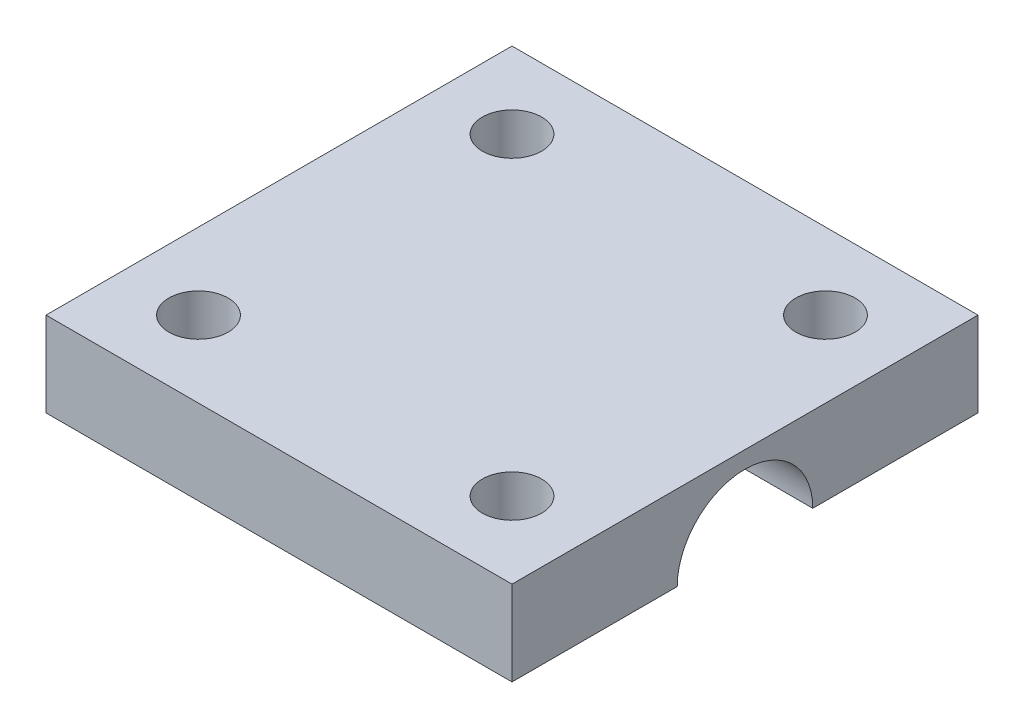
ISO-10303-21;
HEADER;
FILE_DESCRIPTION(('STEP AP214'),'2;1');
FILE_NAME('part.step','',(''),(''),'','','');
FILE_SCHEMA(('AUTOMOTIVE_DESIGN { 1 0 10303 214 1 1 1 1 }'));
ENDSEC;
DATA;
#1=APPLICATION_CONTEXT('core data for automotive mechanical design processes');
#2=APPLICATION_PROTOCOL_DEFINITION('international standard','automotive_design',2000,#1);
#3=PRODUCT_CONTEXT('',#1,'mechanical');
#4=PRODUCT('Part','Part','',(#3));
#5=PRODUCT_RELATED_PRODUCT_CATEGORY('part','',(#4));
#6=PRODUCT_DEFINITION_FORMATION('','',#4);
#7=PRODUCT_DEFINITION_CONTEXT('part definition',#1,'design');
#8=PRODUCT_DEFINITION('design','',#6,#7);
#9=PRODUCT_DEFINITION_SHAPE('','',#8);
#10=(LENGTH_UNIT() NAMED_UNIT(*) SI_UNIT(.MILLI.,.METRE.));
#11=(NAMED_UNIT(*) PLANE_ANGLE_UNIT() SI_UNIT($,.RADIAN.));
#12=(NAMED_UNIT(*) SI_UNIT($,.STERADIAN.) SOLID_ANGLE_UNIT());
#13=UNCERTAINTY_MEASURE_WITH_UNIT(LENGTH_MEASURE(1.E-05),#10,'distance_accuracy_value','');
#14=(GEOMETRIC_REPRESENTATION_CONTEXT(3) GLOBAL_UNCERTAINTY_ASSIGNED_CONTEXT((#13)) GLOBAL_UNIT_ASSIGNED_CONTEXT((#10,
#11,#12)) REPRESENTATION_CONTEXT('',''));
#15=CARTESIAN_POINT('',(0.,0.,0.));
#16=DIRECTION('',(0.,0.,1.));
#17=DIRECTION('',(1.,0.,0.));
#18=AXIS2_PLACEMENT_3D('',#15,#16,#17);
#19=CARTESIAN_POINT('',(27.5,10.,-27.5));
#20=DIRECTION('',(-1.,0.,0.));
#21=DIRECTION('',(0.,0.,1.));
#22=AXIS2_PLACEMENT_3D('',#19,#20,#21);
#23=PLANE('',#22);
#24=DIRECTION('',(0.,0.,-1.));
#25=VECTOR('',#24,1.);
#26=CARTESIAN_POINT('',(27.5,0.,-27.5));
#27=LINE('',#26,#25);
#28=CARTESIAN_POINT('',(27.5,0.,27.5));
#29=VERTEX_POINT('',#28);
#30=CARTESIAN_POINT('',(27.5,0.,8.));
#31=VERTEX_POINT('',#30);
#32=EDGE_CURVE('E125',#29,#31,#27,.T.);
#33=ORIENTED_EDGE('',*,*,#32,.T.);
#34=CARTESIAN_POINT('',(27.5,0.,0.));
#35=DIRECTION('',(1.,0.,0.));
#36=DIRECTION('',(0.,0.,-1.));
#37=AXIS2_PLACEMENT_3D('',#34,#35,#36);
#38=CIRCLE('',#37,8.);
#39=CARTESIAN_POINT('',(27.5,0.,-8.));
#40=VERTEX_POINT('',#39);
#41=EDGE_CURVE('E112',#40,#31,#38,.T.);
#42=ORIENTED_EDGE('',*,*,#41,.F.);
#43=CARTESIAN_POINT('',(27.5,0.,-27.5));
#44=VERTEX_POINT('',#43);
#45=EDGE_CURVE('E122',#40,#44,#27,.T.);
#46=ORIENTED_EDGE('',*,*,#45,.T.);
#47=DIRECTION('',(0.,-1.,0.));
#48=VECTOR('',#47,1.);
#49=CARTESIAN_POINT('',(27.5,10.,-27.5));
#50=LINE('',#49,#48);
#51=CARTESIAN_POINT('',(27.5,10.,-27.5));
#52=VERTEX_POINT('',#51);
#53=EDGE_CURVE('E157',#52,#44,#50,.T.);
#54=ORIENTED_EDGE('',*,*,#53,.F.);
#55=DIRECTION('',(0.,0.,-1.));
#56=VECTOR('',#55,1.);
#57=CARTESIAN_POINT('',(27.5,10.,-27.5));
#58=LINE('',#57,#56);
#59=CARTESIAN_POINT('',(27.5,10.,27.5));
#60=VERTEX_POINT('',#59);
#61=EDGE_CURVE('E146',#60,#52,#58,.T.);
#62=ORIENTED_EDGE('',*,*,#61,.F.);
#63=DIRECTION('',(0.,-1.,0.));
#64=VECTOR('',#63,1.);
#65=CARTESIAN_POINT('',(27.5,10.,27.5));
#66=LINE('',#65,#64);
#67=EDGE_CURVE('E147',#60,#29,#66,.T.);
#68=ORIENTED_EDGE('',*,*,#67,.T.);
#69=EDGE_LOOP('',(#33,#42,#46,#54,#62,#68));
#70=FACE_BOUND('',#69,.T.);
#71=ADVANCED_FACE('F46',(#70),#23,.F.);
#72=CARTESIAN_POINT('',(-27.5,10.,-27.5));
#73=DIRECTION('',(0.,0.,1.));
#74=DIRECTION('',(1.,0.,0.));
#75=AXIS2_PLACEMENT_3D('',#72,#73,#74);
#76=PLANE('',#75);
#77=DIRECTION('',(-1.,0.,0.));
#78=VECTOR('',#77,1.);
#79=CARTESIAN_POINT('',(-27.5,0.,-27.5));
#80=LINE('',#79,#78);
#81=CARTESIAN_POINT('',(-27.5,0.,-27.5));
#82=VERTEX_POINT('',#81);
#83=EDGE_CURVE('E130',#44,#82,#80,.T.);
#84=ORIENTED_EDGE('',*,*,#83,.T.);
#85=DIRECTION('',(0.,-1.,0.));
#86=VECTOR('',#85,1.);
#87=CARTESIAN_POINT('',(-27.5,10.,-27.5));
#88=LINE('',#87,#86);
#89=CARTESIAN_POINT('',(-27.5,10.,-27.5));
#90=VERTEX_POINT('',#89);
#91=EDGE_CURVE('E153',#90,#82,#88,.T.);
#92=ORIENTED_EDGE('',*,*,#91,.F.);
#93=DIRECTION('',(-1.,0.,0.));
#94=VECTOR('',#93,1.);
#95=CARTESIAN_POINT('',(-27.5,10.,-27.5));
#96=LINE('',#95,#94);
#97=EDGE_CURVE('E100',#52,#90,#96,.T.);
#98=ORIENTED_EDGE('',*,*,#97,.F.);
#99=ORIENTED_EDGE('',*,*,#53,.T.);
#100=EDGE_LOOP('',(#84,#92,#98,#99));
#101=FACE_BOUND('',#100,.T.);
#102=ADVANCED_FACE('F194',(#101),#76,.F.);
#103=CARTESIAN_POINT('',(-27.5,10.,-27.5));
#104=DIRECTION('',(1.,0.,0.));
#105=DIRECTION('',(0.,0.,-1.));
#106=AXIS2_PLACEMENT_3D('',#103,#104,#105);
#107=PLANE('',#106);
#108=DIRECTION('',(0.,0.,1.));
#109=VECTOR('',#108,1.);
#110=CARTESIAN_POINT('',(-27.5,0.,-27.5));
#111=LINE('',#110,#109);
#112=CARTESIAN_POINT('',(-27.5,0.,27.5));
#113=VERTEX_POINT('',#112);
#114=EDGE_CURVE('E141',#82,#113,#111,.T.);
#115=ORIENTED_EDGE('',*,*,#114,.T.);
#116=DIRECTION('',(0.,-1.,0.));
#117=VECTOR('',#116,1.);
#118=CARTESIAN_POINT('',(-27.5,10.,27.5));
#119=LINE('',#118,#117);
#120=CARTESIAN_POINT('',(-27.5,10.,27.5));
#121=VERTEX_POINT('',#120);
#122=EDGE_CURVE('E150',#121,#113,#119,.T.);
#123=ORIENTED_EDGE('',*,*,#122,.F.);
#124=DIRECTION('',(0.,0.,1.));
#125=VECTOR('',#124,1.);
#126=CARTESIAN_POINT('',(-27.5,10.,-27.5));
#127=LINE('',#126,#125);
#128=EDGE_CURVE('E243',#90,#121,#127,.T.);
#129=ORIENTED_EDGE('',*,*,#128,.F.);
#130=ORIENTED_EDGE('',*,*,#91,.T.);
#131=EDGE_LOOP('',(#115,#123,#129,#130));
#132=FACE_BOUND('',#131,.T.);
#133=ADVANCED_FACE('F198',(#132),#107,.F.);
#134=CARTESIAN_POINT('',(-27.5,10.,27.5));
#135=DIRECTION('',(0.,0.,-1.));
#136=DIRECTION('',(-1.,0.,0.));
#137=AXIS2_PLACEMENT_3D('',#134,#135,#136);
#138=PLANE('',#137);
#139=DIRECTION('',(1.,0.,0.));
#140=VECTOR('',#139,1.);
#141=CARTESIAN_POINT('',(-27.5,0.,27.5));
#142=LINE('',#141,#140);
#143=EDGE_CURVE('E92',#113,#29,#142,.T.);
#144=ORIENTED_EDGE('',*,*,#143,.T.);
#145=ORIENTED_EDGE('',*,*,#67,.F.);
#146=DIRECTION('',(1.,0.,0.));
#147=VECTOR('',#146,1.);
#148=CARTESIAN_POINT('',(-27.5,10.,27.5));
#149=LINE('',#148,#147);
#150=EDGE_CURVE('E71',#121,#60,#149,.T.);
#151=ORIENTED_EDGE('',*,*,#150,.F.);
#152=ORIENTED_EDGE('',*,*,#122,.T.);
#153=EDGE_LOOP('',(#144,#145,#151,#152));
#154=FACE_BOUND('',#153,.T.);
#155=ADVANCED_FACE('F202',(#154),#138,.F.);
#156=CARTESIAN_POINT('',(0.,10.,0.));
#157=DIRECTION('',(0.,1.,0.));
#158=DIRECTION('',(0.,0.,1.));
#159=AXIS2_PLACEMENT_3D('',#156,#157,#158);
#160=PLANE('',#159);
#161=CARTESIAN_POINT('',(18.5,10.,-18.5));
#162=DIRECTION('',(0.,1.,0.));
#163=DIRECTION('',(0.,0.,1.));
#164=AXIS2_PLACEMENT_3D('',#161,#162,#163);
#165=CIRCLE('',#164,3.5);
#166=CARTESIAN_POINT('',(18.5,10.,-15.));
#167=VERTEX_POINT('',#166);
#168=EDGE_CURVE('E233',#167,#167,#165,.T.);
#169=ORIENTED_EDGE('',*,*,#168,.F.);
#170=EDGE_LOOP('',(#169));
#171=FACE_BOUND('',#170,.T.);
#172=CARTESIAN_POINT('',(-18.5,10.,18.5));
#173=DIRECTION('',(0.,1.,0.));
#174=DIRECTION('',(0.,0.,1.));
#175=AXIS2_PLACEMENT_3D('',#172,#173,#174);
#176=CIRCLE('',#175,3.5);
#177=CARTESIAN_POINT('',(-18.5,10.,22.));
#178=VERTEX_POINT('',#177);
#179=EDGE_CURVE('E236',#178,#178,#176,.T.);
#180=ORIENTED_EDGE('',*,*,#179,.F.);
#181=EDGE_LOOP('',(#180));
#182=FACE_BOUND('',#181,.T.);
#183=CARTESIAN_POINT('',(18.5,10.,18.5));
#184=DIRECTION('',(0.,1.,0.));
#185=DIRECTION('',(0.,0.,1.));
#186=AXIS2_PLACEMENT_3D('',#183,#184,#185);
#187=CIRCLE('',#186,3.5);
#188=CARTESIAN_POINT('',(18.5,10.,22.));
#189=VERTEX_POINT('',#188);
#190=EDGE_CURVE('E251',#189,#189,#187,.T.);
#191=ORIENTED_EDGE('',*,*,#190,.F.);
#192=EDGE_LOOP('',(#191));
#193=FACE_BOUND('',#192,.T.);
#194=CARTESIAN_POINT('',(-18.5,10.,-18.5));
#195=DIRECTION('',(0.,1.,0.));
#196=DIRECTION('',(0.,0.,1.));
#197=AXIS2_PLACEMENT_3D('',#194,#195,#196);
#198=CIRCLE('',#197,3.5);
#199=CARTESIAN_POINT('',(-18.5,10.,-15.));
#200=VERTEX_POINT('',#199);
#201=EDGE_CURVE('E167',#200,#200,#198,.T.);
#202=ORIENTED_EDGE('',*,*,#201,.F.);
#203=EDGE_LOOP('',(#202));
#204=FACE_BOUND('',#203,.T.);
#205=ORIENTED_EDGE('',*,*,#61,.T.);
#206=ORIENTED_EDGE('',*,*,#97,.T.);
#207=ORIENTED_EDGE('',*,*,#128,.T.);
#208=ORIENTED_EDGE('',*,*,#150,.T.);
#209=EDGE_LOOP('',(#205,#206,#207,#208));
#210=FACE_BOUND('',#209,.T.);
#211=ADVANCED_FACE('F208',(#171,#182,#193,#204,#210),#160,.T.);
#212=CARTESIAN_POINT('',(0.,0.,0.));
#213=DIRECTION('',(0.,1.,0.));
#214=DIRECTION('',(0.,0.,1.));
#215=AXIS2_PLACEMENT_3D('',#212,#213,#214);
#216=PLANE('',#215);
#217=CARTESIAN_POINT('',(18.5,0.,-18.5));
#218=DIRECTION('',(0.,1.,0.));
#219=DIRECTION('',(0.,0.,1.));
#220=AXIS2_PLACEMENT_3D('',#217,#218,#219);
#221=CIRCLE('',#220,3.5);
#222=CARTESIAN_POINT('',(18.5,0.,-15.));
#223=VERTEX_POINT('',#222);
#224=EDGE_CURVE('E49',#223,#223,#221,.T.);
#225=ORIENTED_EDGE('',*,*,#224,.T.);
#226=EDGE_LOOP('',(#225));
#227=FACE_BOUND('',#226,.T.);
#228=CARTESIAN_POINT('',(-18.5,0.,18.5));
#229=DIRECTION('',(0.,1.,0.));
#230=DIRECTION('',(0.,0.,1.));
#231=AXIS2_PLACEMENT_3D('',#228,#229,#230);
#232=CIRCLE('',#231,3.5);
#233=CARTESIAN_POINT('',(-18.5,0.,22.));
#234=VERTEX_POINT('',#233);
#235=EDGE_CURVE('E170',#234,#234,#232,.T.);
#236=ORIENTED_EDGE('',*,*,#235,.T.);
#237=EDGE_LOOP('',(#236));
#238=FACE_BOUND('',#237,.T.);
#239=CARTESIAN_POINT('',(18.5,0.,18.5));
#240=DIRECTION('',(0.,1.,0.));
#241=DIRECTION('',(0.,0.,1.));
#242=AXIS2_PLACEMENT_3D('',#239,#240,#241);
#243=CIRCLE('',#242,3.5);
#244=CARTESIAN_POINT('',(18.5,0.,22.));
#245=VERTEX_POINT('',#244);
#246=EDGE_CURVE('E166',#245,#245,#243,.T.);
#247=ORIENTED_EDGE('',*,*,#246,.T.);
#248=EDGE_LOOP('',(#247));
#249=FACE_BOUND('',#248,.T.);
#250=CARTESIAN_POINT('',(-18.5,0.,-18.5));
#251=DIRECTION('',(0.,1.,0.));
#252=DIRECTION('',(0.,0.,1.));
#253=AXIS2_PLACEMENT_3D('',#250,#251,#252);
#254=CIRCLE('',#253,3.5);
#255=CARTESIAN_POINT('',(-18.5,0.,-15.));
#256=VERTEX_POINT('',#255);
#257=EDGE_CURVE('E162',#256,#256,#254,.T.);
#258=ORIENTED_EDGE('',*,*,#257,.T.);
#259=EDGE_LOOP('',(#258));
#260=FACE_BOUND('',#259,.T.);
#261=DIRECTION('',(0.,0.,-1.));
#262=VECTOR('',#261,1.);
#263=CARTESIAN_POINT('',(-22.5,0.,0.));
#264=LINE('',#263,#262);
#265=CARTESIAN_POINT('',(-22.5,0.,8.));
#266=VERTEX_POINT('',#265);
#267=CARTESIAN_POINT('',(-22.5,0.,-8.));
#268=VERTEX_POINT('',#267);
#269=EDGE_CURVE('E117',#266,#268,#264,.T.);
#270=ORIENTED_EDGE('',*,*,#269,.F.);
#271=DIRECTION('',(1.,0.,0.));
#272=VECTOR('',#271,1.);
#273=CARTESIAN_POINT('',(-22.5,0.,8.));
#274=LINE('',#273,#272);
#275=EDGE_CURVE('E11',#266,#31,#274,.T.);
#276=ORIENTED_EDGE('',*,*,#275,.T.);
#277=ORIENTED_EDGE('',*,*,#32,.F.);
#278=ORIENTED_EDGE('',*,*,#143,.F.);
#279=ORIENTED_EDGE('',*,*,#114,.F.);
#280=ORIENTED_EDGE('',*,*,#83,.F.);
#281=ORIENTED_EDGE('',*,*,#45,.F.);
#282=DIRECTION('',(1.,0.,0.));
#283=VECTOR('',#282,1.);
#284=CARTESIAN_POINT('',(-22.5,0.,-8.));
#285=LINE('',#284,#283);
#286=EDGE_CURVE('E55',#40,#268,#285,.F.);
#287=ORIENTED_EDGE('',*,*,#286,.T.);
#288=EDGE_LOOP('',(#270,#276,#277,#278,#279,#280,#281,#287));
#289=FACE_BOUND('',#288,.T.);
#290=ADVANCED_FACE('F128',(#227,#238,#249,#260,#289),#216,.F.);
#291=CARTESIAN_POINT('',(-22.5,0.,0.));
#292=DIRECTION('',(1.,0.,0.));
#293=DIRECTION('',(0.,0.,-1.));
#294=AXIS2_PLACEMENT_3D('',#291,#292,#293);
#295=CYLINDRICAL_SURFACE('',#294,8.);
#296=CARTESIAN_POINT('',(-22.5,0.,0.));
#297=DIRECTION('',(1.,0.,0.));
#298=DIRECTION('',(0.,0.,-1.));
#299=AXIS2_PLACEMENT_3D('',#296,#297,#298);
#300=CIRCLE('',#299,8.);
#301=EDGE_CURVE('E62',#268,#266,#300,.T.);
#302=ORIENTED_EDGE('',*,*,#301,.F.);
#303=ORIENTED_EDGE('',*,*,#286,.F.);
#304=ORIENTED_EDGE('',*,*,#41,.T.);
#305=ORIENTED_EDGE('',*,*,#275,.F.);
#306=EDGE_LOOP('',(#302,#303,#304,#305));
#307=FACE_BOUND('',#306,.T.);
#308=ADVANCED_FACE('F111',(#307),#295,.F.);
#309=CARTESIAN_POINT('',(-22.5,0.,0.));
#310=DIRECTION('',(1.,0.,0.));
#311=DIRECTION('',(0.,0.,-1.));
#312=AXIS2_PLACEMENT_3D('',#309,#310,#311);
#313=PLANE('',#312);
#314=ORIENTED_EDGE('',*,*,#269,.T.);
#315=ORIENTED_EDGE('',*,*,#301,.T.);
#316=EDGE_LOOP('',(#314,#315));
#317=FACE_BOUND('',#316,.T.);
#318=ADVANCED_FACE('F216',(#317),#313,.T.);
#319=CARTESIAN_POINT('',(-18.5,-40.,-18.5));
#320=DIRECTION('',(0.,1.,0.));
#321=DIRECTION('',(0.,0.,1.));
#322=AXIS2_PLACEMENT_3D('',#319,#320,#321);
#323=CYLINDRICAL_SURFACE('',#322,3.5);
#324=ORIENTED_EDGE('',*,*,#201,.T.);
#325=EDGE_LOOP('',(#324));
#326=FACE_BOUND('',#325,.T.);
#327=ORIENTED_EDGE('',*,*,#257,.F.);
#328=EDGE_LOOP('',(#327));
#329=FACE_BOUND('',#328,.T.);
#330=ADVANCED_FACE('F219',(#326,#329),#323,.F.);
#331=CARTESIAN_POINT('',(18.5,-40.,18.5));
#332=DIRECTION('',(0.,1.,0.));
#333=DIRECTION('',(0.,0.,1.));
#334=AXIS2_PLACEMENT_3D('',#331,#332,#333);
#335=CYLINDRICAL_SURFACE('',#334,3.5);
#336=ORIENTED_EDGE('',*,*,#190,.T.);
#337=EDGE_LOOP('',(#336));
#338=FACE_BOUND('',#337,.T.);
#339=ORIENTED_EDGE('',*,*,#246,.F.);
#340=EDGE_LOOP('',(#339));
#341=FACE_BOUND('',#340,.T.);
#342=ADVANCED_FACE('F188',(#338,#341),#335,.F.);
#343=CARTESIAN_POINT('',(-18.5,-40.,18.5));
#344=DIRECTION('',(0.,1.,0.));
#345=DIRECTION('',(0.,0.,1.));
#346=AXIS2_PLACEMENT_3D('',#343,#344,#345);
#347=CYLINDRICAL_SURFACE('',#346,3.5);
#348=ORIENTED_EDGE('',*,*,#179,.T.);
#349=EDGE_LOOP('',(#348));
#350=FACE_BOUND('',#349,.T.);
#351=ORIENTED_EDGE('',*,*,#235,.F.);
#352=EDGE_LOOP('',(#351));
#353=FACE_BOUND('',#352,.T.);
#354=ADVANCED_FACE('F182',(#350,#353),#347,.F.);
#355=CARTESIAN_POINT('',(18.5,-40.,-18.5));
#356=DIRECTION('',(0.,1.,0.));
#357=DIRECTION('',(0.,0.,1.));
#358=AXIS2_PLACEMENT_3D('',#355,#356,#357);
#359=CYLINDRICAL_SURFACE('',#358,3.5);
#360=ORIENTED_EDGE('',*,*,#168,.T.);
#361=EDGE_LOOP('',(#360));
#362=FACE_BOUND('',#361,.T.);
#363=ORIENTED_EDGE('',*,*,#224,.F.);
#364=EDGE_LOOP('',(#363));
#365=FACE_BOUND('',#364,.T.);
#366=ADVANCED_FACE('F180',(#362,#365),#359,.F.);
#367=CLOSED_SHELL('',(#71,#102,#133,#155,#211,#290,#308,#318,#330,#342,#354,#366));
#368=MANIFOLD_SOLID_BREP('B2',#367);
#369=ADVANCED_BREP_SHAPE_REPRESENTATION('',(#18,#368),#14);
#370=SHAPE_DEFINITION_REPRESENTATION(#9,#369);
ENDSEC;
END-ISO-10303-21;
